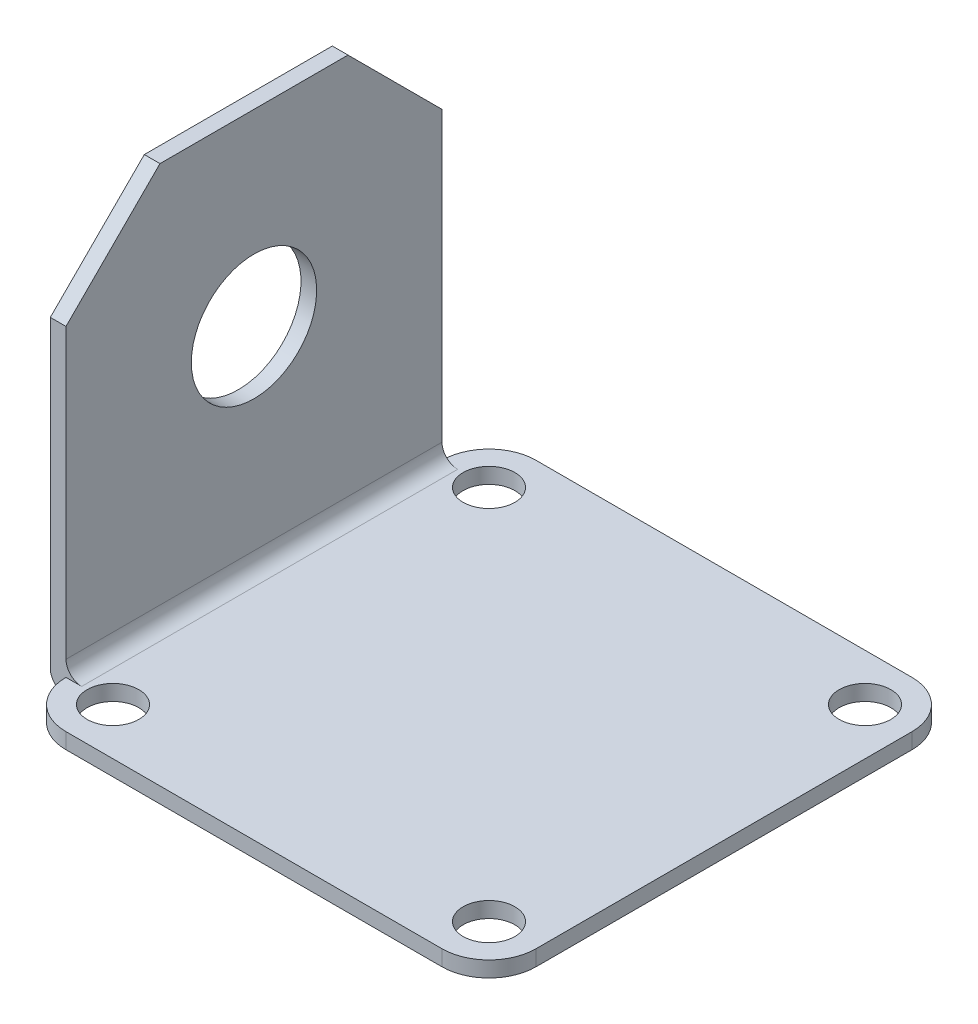
ISO-10303-21;
HEADER;
FILE_DESCRIPTION(('STEP AP214'),'2;1');
FILE_NAME('part.step','',(''),(''),'','','');
FILE_SCHEMA(('AUTOMOTIVE_DESIGN { 1 0 10303 214 1 1 1 1 }'));
ENDSEC;
DATA;
#1=APPLICATION_CONTEXT('core data for automotive mechanical design processes');
#2=APPLICATION_PROTOCOL_DEFINITION('international standard','automotive_design',2000,#1);
#3=PRODUCT_CONTEXT('',#1,'mechanical');
#4=PRODUCT('Part','Part','',(#3));
#5=PRODUCT_RELATED_PRODUCT_CATEGORY('part','',(#4));
#6=PRODUCT_DEFINITION_FORMATION('','',#4);
#7=PRODUCT_DEFINITION_CONTEXT('part definition',#1,'design');
#8=PRODUCT_DEFINITION('design','',#6,#7);
#9=PRODUCT_DEFINITION_SHAPE('','',#8);
#10=(LENGTH_UNIT() NAMED_UNIT(*) SI_UNIT(.MILLI.,.METRE.));
#11=(NAMED_UNIT(*) PLANE_ANGLE_UNIT() SI_UNIT($,.RADIAN.));
#12=(NAMED_UNIT(*) SI_UNIT($,.STERADIAN.) SOLID_ANGLE_UNIT());
#13=UNCERTAINTY_MEASURE_WITH_UNIT(LENGTH_MEASURE(1.E-05),#10,'distance_accuracy_value','');
#14=(GEOMETRIC_REPRESENTATION_CONTEXT(3) GLOBAL_UNCERTAINTY_ASSIGNED_CONTEXT((#13)) GLOBAL_UNIT_ASSIGNED_CONTEXT((#10,
#11,#12)) REPRESENTATION_CONTEXT('',''));
#15=CARTESIAN_POINT('',(0.,0.,0.));
#16=DIRECTION('',(0.,0.,1.));
#17=DIRECTION('',(1.,0.,0.));
#18=AXIS2_PLACEMENT_3D('',#15,#16,#17);
#19=CARTESIAN_POINT('',(3.,26.4,12.));
#20=DIRECTION('',(0.,-1.,0.));
#21=DIRECTION('',(0.,0.,-1.));
#22=AXIS2_PLACEMENT_3D('',#19,#20,#21);
#23=CYLINDRICAL_SURFACE('',#22,3.);
#24=CARTESIAN_POINT('',(3.,1.,12.));
#25=DIRECTION('',(0.,1.,0.));
#26=DIRECTION('',(0.,0.,1.));
#27=AXIS2_PLACEMENT_3D('',#24,#25,#26);
#28=CIRCLE('',#27,3.);
#29=CARTESIAN_POINT('',(0.,1.,12.));
#30=VERTEX_POINT('',#29);
#31=CARTESIAN_POINT('',(3.00000000000002,1.,15.));
#32=VERTEX_POINT('',#31);
#33=EDGE_CURVE('E283',#30,#32,#28,.T.);
#34=ORIENTED_EDGE('',*,*,#33,.F.);
#35=DIRECTION('',(0.,-1.,0.));
#36=VECTOR('',#35,1.);
#37=CARTESIAN_POINT('',(0.,26.4,12.));
#38=LINE('',#37,#36);
#39=CARTESIAN_POINT('',(0.,0.,12.));
#40=VERTEX_POINT('',#39);
#41=EDGE_CURVE('E189',#30,#40,#38,.T.);
#42=ORIENTED_EDGE('',*,*,#41,.T.);
#43=CARTESIAN_POINT('',(3.,0.,12.));
#44=DIRECTION('',(0.,1.,0.));
#45=DIRECTION('',(0.,0.,1.));
#46=AXIS2_PLACEMENT_3D('',#43,#44,#45);
#47=CIRCLE('',#46,3.);
#48=CARTESIAN_POINT('',(3.00000000000002,0.,15.));
#49=VERTEX_POINT('',#48);
#50=EDGE_CURVE('E297',#40,#49,#47,.T.);
#51=ORIENTED_EDGE('',*,*,#50,.T.);
#52=DIRECTION('',(0.,-1.,0.));
#53=VECTOR('',#52,1.);
#54=CARTESIAN_POINT('',(3.00000000000002,26.4,15.));
#55=LINE('',#54,#53);
#56=EDGE_CURVE('E187',#32,#49,#55,.T.);
#57=ORIENTED_EDGE('',*,*,#56,.F.);
#58=EDGE_LOOP('',(#34,#42,#51,#57));
#59=FACE_BOUND('',#58,.T.);
#60=ADVANCED_FACE('F33',(#59),#23,.T.);
#61=CARTESIAN_POINT('',(3.00000000000002,26.4,15.));
#62=DIRECTION('',(0.,0.,-1.));
#63=DIRECTION('',(-1.,0.,0.));
#64=AXIS2_PLACEMENT_3D('',#61,#62,#63);
#65=PLANE('',#64);
#66=DIRECTION('',(1.,0.,0.));
#67=VECTOR('',#66,1.);
#68=CARTESIAN_POINT('',(3.00000000000002,1.,15.));
#69=LINE('',#68,#67);
#70=CARTESIAN_POINT('',(27.,1.,15.));
#71=VERTEX_POINT('',#70);
#72=EDGE_CURVE('E281',#32,#71,#69,.T.);
#73=ORIENTED_EDGE('',*,*,#72,.F.);
#74=ORIENTED_EDGE('',*,*,#56,.T.);
#75=DIRECTION('',(1.,0.,0.));
#76=VECTOR('',#75,1.);
#77=CARTESIAN_POINT('',(3.00000000000002,0.,15.));
#78=LINE('',#77,#76);
#79=CARTESIAN_POINT('',(27.,0.,15.));
#80=VERTEX_POINT('',#79);
#81=EDGE_CURVE('E300',#49,#80,#78,.T.);
#82=ORIENTED_EDGE('',*,*,#81,.T.);
#83=DIRECTION('',(0.,-1.,0.));
#84=VECTOR('',#83,1.);
#85=CARTESIAN_POINT('',(27.,26.4,15.));
#86=LINE('',#85,#84);
#87=EDGE_CURVE('E185',#71,#80,#86,.T.);
#88=ORIENTED_EDGE('',*,*,#87,.F.);
#89=EDGE_LOOP('',(#73,#74,#82,#88));
#90=FACE_BOUND('',#89,.T.);
#91=ADVANCED_FACE('F335',(#90),#65,.F.);
#92=CARTESIAN_POINT('',(27.,26.4,12.));
#93=DIRECTION('',(0.,-1.,0.));
#94=DIRECTION('',(0.,0.,-1.));
#95=AXIS2_PLACEMENT_3D('',#92,#93,#94);
#96=CYLINDRICAL_SURFACE('',#95,3.);
#97=CARTESIAN_POINT('',(27.,1.,12.));
#98=DIRECTION('',(0.,1.,0.));
#99=DIRECTION('',(0.,0.,1.));
#100=AXIS2_PLACEMENT_3D('',#97,#98,#99);
#101=CIRCLE('',#100,3.);
#102=CARTESIAN_POINT('',(30.,1.,12.));
#103=VERTEX_POINT('',#102);
#104=EDGE_CURVE('E279',#71,#103,#101,.T.);
#105=ORIENTED_EDGE('',*,*,#104,.F.);
#106=ORIENTED_EDGE('',*,*,#87,.T.);
#107=CARTESIAN_POINT('',(27.,0.,12.));
#108=DIRECTION('',(0.,1.,0.));
#109=DIRECTION('',(0.,0.,1.));
#110=AXIS2_PLACEMENT_3D('',#107,#108,#109);
#111=CIRCLE('',#110,3.);
#112=CARTESIAN_POINT('',(30.,0.,12.));
#113=VERTEX_POINT('',#112);
#114=EDGE_CURVE('E303',#80,#113,#111,.T.);
#115=ORIENTED_EDGE('',*,*,#114,.T.);
#116=DIRECTION('',(0.,-1.,0.));
#117=VECTOR('',#116,1.);
#118=CARTESIAN_POINT('',(30.,26.4,12.));
#119=LINE('',#118,#117);
#120=EDGE_CURVE('E183',#103,#113,#119,.T.);
#121=ORIENTED_EDGE('',*,*,#120,.F.);
#122=EDGE_LOOP('',(#105,#106,#115,#121));
#123=FACE_BOUND('',#122,.T.);
#124=ADVANCED_FACE('F330',(#123),#96,.T.);
#125=CARTESIAN_POINT('',(30.,26.4,12.));
#126=DIRECTION('',(-1.,0.,0.));
#127=DIRECTION('',(0.,0.,1.));
#128=AXIS2_PLACEMENT_3D('',#125,#126,#127);
#129=PLANE('',#128);
#130=DIRECTION('',(0.,0.,-1.));
#131=VECTOR('',#130,1.);
#132=CARTESIAN_POINT('',(30.,1.,12.));
#133=LINE('',#132,#131);
#134=CARTESIAN_POINT('',(30.,1.,-12.));
#135=VERTEX_POINT('',#134);
#136=EDGE_CURVE('E277',#103,#135,#133,.T.);
#137=ORIENTED_EDGE('',*,*,#136,.F.);
#138=ORIENTED_EDGE('',*,*,#120,.T.);
#139=DIRECTION('',(0.,0.,-1.));
#140=VECTOR('',#139,1.);
#141=CARTESIAN_POINT('',(30.,0.,12.));
#142=LINE('',#141,#140);
#143=CARTESIAN_POINT('',(30.,0.,-12.));
#144=VERTEX_POINT('',#143);
#145=EDGE_CURVE('E306',#113,#144,#142,.T.);
#146=ORIENTED_EDGE('',*,*,#145,.T.);
#147=DIRECTION('',(0.,-1.,0.));
#148=VECTOR('',#147,1.);
#149=CARTESIAN_POINT('',(30.,26.4,-12.));
#150=LINE('',#149,#148);
#151=EDGE_CURVE('E181',#135,#144,#150,.T.);
#152=ORIENTED_EDGE('',*,*,#151,.F.);
#153=EDGE_LOOP('',(#137,#138,#146,#152));
#154=FACE_BOUND('',#153,.T.);
#155=ADVANCED_FACE('F326',(#154),#129,.F.);
#156=CARTESIAN_POINT('',(27.,26.4,-12.));
#157=DIRECTION('',(0.,-1.,0.));
#158=DIRECTION('',(0.,0.,-1.));
#159=AXIS2_PLACEMENT_3D('',#156,#157,#158);
#160=CYLINDRICAL_SURFACE('',#159,3.);
#161=CARTESIAN_POINT('',(27.,1.,-12.));
#162=DIRECTION('',(0.,1.,0.));
#163=DIRECTION('',(0.,0.,1.));
#164=AXIS2_PLACEMENT_3D('',#161,#162,#163);
#165=CIRCLE('',#164,3.);
#166=CARTESIAN_POINT('',(27.,1.,-15.));
#167=VERTEX_POINT('',#166);
#168=EDGE_CURVE('E275',#135,#167,#165,.T.);
#169=ORIENTED_EDGE('',*,*,#168,.F.);
#170=ORIENTED_EDGE('',*,*,#151,.T.);
#171=CARTESIAN_POINT('',(27.,0.,-12.));
#172=DIRECTION('',(0.,1.,0.));
#173=DIRECTION('',(0.,0.,1.));
#174=AXIS2_PLACEMENT_3D('',#171,#172,#173);
#175=CIRCLE('',#174,3.);
#176=CARTESIAN_POINT('',(27.,0.,-15.));
#177=VERTEX_POINT('',#176);
#178=EDGE_CURVE('E309',#144,#177,#175,.T.);
#179=ORIENTED_EDGE('',*,*,#178,.T.);
#180=DIRECTION('',(0.,-1.,0.));
#181=VECTOR('',#180,1.);
#182=CARTESIAN_POINT('',(27.,26.4,-15.));
#183=LINE('',#182,#181);
#184=EDGE_CURVE('E179',#167,#177,#183,.T.);
#185=ORIENTED_EDGE('',*,*,#184,.F.);
#186=EDGE_LOOP('',(#169,#170,#179,#185));
#187=FACE_BOUND('',#186,.T.);
#188=ADVANCED_FACE('F322',(#187),#160,.T.);
#189=CARTESIAN_POINT('',(27.,26.4,-15.));
#190=DIRECTION('',(0.,0.,1.));
#191=DIRECTION('',(1.,0.,0.));
#192=AXIS2_PLACEMENT_3D('',#189,#190,#191);
#193=PLANE('',#192);
#194=DIRECTION('',(-1.,0.,0.));
#195=VECTOR('',#194,1.);
#196=CARTESIAN_POINT('',(27.,1.,-15.));
#197=LINE('',#196,#195);
#198=CARTESIAN_POINT('',(3.00000000000002,1.,-15.));
#199=VERTEX_POINT('',#198);
#200=EDGE_CURVE('E242',#167,#199,#197,.T.);
#201=ORIENTED_EDGE('',*,*,#200,.F.);
#202=ORIENTED_EDGE('',*,*,#184,.T.);
#203=DIRECTION('',(-1.,0.,0.));
#204=VECTOR('',#203,1.);
#205=CARTESIAN_POINT('',(27.,0.,-15.));
#206=LINE('',#205,#204);
#207=CARTESIAN_POINT('',(3.00000000000002,0.,-15.));
#208=VERTEX_POINT('',#207);
#209=EDGE_CURVE('E170',#177,#208,#206,.T.);
#210=ORIENTED_EDGE('',*,*,#209,.T.);
#211=DIRECTION('',(0.,-1.,0.));
#212=VECTOR('',#211,1.);
#213=CARTESIAN_POINT('',(3.00000000000002,26.4,-15.));
#214=LINE('',#213,#212);
#215=EDGE_CURVE('E177',#199,#208,#214,.T.);
#216=ORIENTED_EDGE('',*,*,#215,.F.);
#217=EDGE_LOOP('',(#201,#202,#210,#216));
#218=FACE_BOUND('',#217,.T.);
#219=ADVANCED_FACE('F312',(#218),#193,.F.);
#220=CARTESIAN_POINT('',(3.,26.4,-12.));
#221=DIRECTION('',(0.,-1.,0.));
#222=DIRECTION('',(0.,0.,-1.));
#223=AXIS2_PLACEMENT_3D('',#220,#221,#222);
#224=CYLINDRICAL_SURFACE('',#223,3.);
#225=CARTESIAN_POINT('',(3.,1.,-12.));
#226=DIRECTION('',(0.,1.,0.));
#227=DIRECTION('',(0.,0.,1.));
#228=AXIS2_PLACEMENT_3D('',#225,#226,#227);
#229=CIRCLE('',#228,3.);
#230=CARTESIAN_POINT('',(0.,1.,-12.));
#231=VERTEX_POINT('',#230);
#232=EDGE_CURVE('E239',#199,#231,#229,.T.);
#233=ORIENTED_EDGE('',*,*,#232,.F.);
#234=ORIENTED_EDGE('',*,*,#215,.T.);
#235=CARTESIAN_POINT('',(3.,0.,-12.));
#236=DIRECTION('',(0.,1.,0.));
#237=DIRECTION('',(0.,0.,1.));
#238=AXIS2_PLACEMENT_3D('',#235,#236,#237);
#239=CIRCLE('',#238,3.);
#240=CARTESIAN_POINT('',(0.,0.,-12.));
#241=VERTEX_POINT('',#240);
#242=EDGE_CURVE('E165',#208,#241,#239,.T.);
#243=ORIENTED_EDGE('',*,*,#242,.T.);
#244=DIRECTION('',(0.,-1.,0.));
#245=VECTOR('',#244,1.);
#246=CARTESIAN_POINT('',(0.,26.4,-12.));
#247=LINE('',#246,#245);
#248=EDGE_CURVE('E167',#231,#241,#247,.T.);
#249=ORIENTED_EDGE('',*,*,#248,.F.);
#250=EDGE_LOOP('',(#233,#234,#243,#249));
#251=FACE_BOUND('',#250,.T.);
#252=ADVANCED_FACE('F247',(#251),#224,.T.);
#253=CARTESIAN_POINT('',(27.,26.4,12.));
#254=DIRECTION('',(0.,-1.,0.));
#255=DIRECTION('',(0.,0.,-1.));
#256=AXIS2_PLACEMENT_3D('',#253,#254,#255);
#257=CYLINDRICAL_SURFACE('',#256,1.65);
#258=CARTESIAN_POINT('',(27.,0.,12.));
#259=DIRECTION('',(0.,1.,0.));
#260=DIRECTION('',(0.,0.,1.));
#261=AXIS2_PLACEMENT_3D('',#258,#259,#260);
#262=CIRCLE('',#261,1.65);
#263=CARTESIAN_POINT('',(27.,0.,13.65));
#264=VERTEX_POINT('',#263);
#265=EDGE_CURVE('E294',#264,#264,#262,.T.);
#266=ORIENTED_EDGE('',*,*,#265,.F.);
#267=EDGE_LOOP('',(#266));
#268=FACE_BOUND('',#267,.T.);
#269=CARTESIAN_POINT('',(27.,1.,12.));
#270=DIRECTION('',(0.,1.,0.));
#271=DIRECTION('',(0.,0.,1.));
#272=AXIS2_PLACEMENT_3D('',#269,#270,#271);
#273=CIRCLE('',#272,1.65);
#274=CARTESIAN_POINT('',(27.,1.,13.65));
#275=VERTEX_POINT('',#274);
#276=EDGE_CURVE('E245',#275,#275,#273,.T.);
#277=ORIENTED_EDGE('',*,*,#276,.T.);
#278=EDGE_LOOP('',(#277));
#279=FACE_BOUND('',#278,.T.);
#280=ADVANCED_FACE('F386',(#268,#279),#257,.F.);
#281=CARTESIAN_POINT('',(3.00000000000001,26.4,12.));
#282=DIRECTION('',(0.,-1.,0.));
#283=DIRECTION('',(0.,0.,-1.));
#284=AXIS2_PLACEMENT_3D('',#281,#282,#283);
#285=CYLINDRICAL_SURFACE('',#284,1.65);
#286=CARTESIAN_POINT('',(3.00000000000001,0.,12.));
#287=DIRECTION('',(0.,1.,0.));
#288=DIRECTION('',(0.,0.,-1.));
#289=AXIS2_PLACEMENT_3D('',#286,#287,#288);
#290=CIRCLE('',#289,1.65);
#291=CARTESIAN_POINT('',(3.00000000000001,0.,10.35));
#292=VERTEX_POINT('',#291);
#293=EDGE_CURVE('E291',#292,#292,#290,.T.);
#294=ORIENTED_EDGE('',*,*,#293,.F.);
#295=EDGE_LOOP('',(#294));
#296=FACE_BOUND('',#295,.T.);
#297=CARTESIAN_POINT('',(3.00000000000001,1.,12.));
#298=DIRECTION('',(0.,1.,0.));
#299=DIRECTION('',(0.,0.,1.));
#300=AXIS2_PLACEMENT_3D('',#297,#298,#299);
#301=CIRCLE('',#300,1.65);
#302=CARTESIAN_POINT('',(3.00000000000001,1.,13.65));
#303=VERTEX_POINT('',#302);
#304=EDGE_CURVE('E269',#303,#303,#301,.T.);
#305=ORIENTED_EDGE('',*,*,#304,.T.);
#306=EDGE_LOOP('',(#305));
#307=FACE_BOUND('',#306,.T.);
#308=ADVANCED_FACE('F382',(#296,#307),#285,.F.);
#309=CARTESIAN_POINT('',(3.00000000000001,26.4,-12.));
#310=DIRECTION('',(0.,-1.,0.));
#311=DIRECTION('',(0.,0.,-1.));
#312=AXIS2_PLACEMENT_3D('',#309,#310,#311);
#313=CYLINDRICAL_SURFACE('',#312,1.65);
#314=CARTESIAN_POINT('',(3.00000000000001,0.,-12.));
#315=DIRECTION('',(0.,1.,0.));
#316=DIRECTION('',(0.,0.,1.));
#317=AXIS2_PLACEMENT_3D('',#314,#315,#316);
#318=CIRCLE('',#317,1.65);
#319=CARTESIAN_POINT('',(3.00000000000001,0.,-10.35));
#320=VERTEX_POINT('',#319);
#321=EDGE_CURVE('E288',#320,#320,#318,.T.);
#322=ORIENTED_EDGE('',*,*,#321,.F.);
#323=EDGE_LOOP('',(#322));
#324=FACE_BOUND('',#323,.T.);
#325=CARTESIAN_POINT('',(3.00000000000001,1.,-12.));
#326=DIRECTION('',(0.,1.,0.));
#327=DIRECTION('',(0.,0.,1.));
#328=AXIS2_PLACEMENT_3D('',#325,#326,#327);
#329=CIRCLE('',#328,1.65);
#330=CARTESIAN_POINT('',(3.00000000000001,1.,-10.35));
#331=VERTEX_POINT('',#330);
#332=EDGE_CURVE('E198',#331,#331,#329,.T.);
#333=ORIENTED_EDGE('',*,*,#332,.T.);
#334=EDGE_LOOP('',(#333));
#335=FACE_BOUND('',#334,.T.);
#336=ADVANCED_FACE('F378',(#324,#335),#313,.F.);
#337=CARTESIAN_POINT('',(27.,26.4,-12.));
#338=DIRECTION('',(0.,-1.,0.));
#339=DIRECTION('',(0.,0.,-1.));
#340=AXIS2_PLACEMENT_3D('',#337,#338,#339);
#341=CYLINDRICAL_SURFACE('',#340,1.65);
#342=CARTESIAN_POINT('',(27.,0.,-12.));
#343=DIRECTION('',(0.,1.,0.));
#344=DIRECTION('',(0.,0.,-1.));
#345=AXIS2_PLACEMENT_3D('',#342,#343,#344);
#346=CIRCLE('',#345,1.65);
#347=CARTESIAN_POINT('',(27.,0.,-13.65));
#348=VERTEX_POINT('',#347);
#349=EDGE_CURVE('E285',#348,#348,#346,.T.);
#350=ORIENTED_EDGE('',*,*,#349,.F.);
#351=EDGE_LOOP('',(#350));
#352=FACE_BOUND('',#351,.T.);
#353=CARTESIAN_POINT('',(27.,1.,-12.));
#354=DIRECTION('',(0.,1.,0.));
#355=DIRECTION('',(0.,0.,1.));
#356=AXIS2_PLACEMENT_3D('',#353,#354,#355);
#357=CIRCLE('',#356,1.65);
#358=CARTESIAN_POINT('',(27.,1.,-10.35));
#359=VERTEX_POINT('',#358);
#360=EDGE_CURVE('E195',#359,#359,#357,.T.);
#361=ORIENTED_EDGE('',*,*,#360,.T.);
#362=EDGE_LOOP('',(#361));
#363=FACE_BOUND('',#362,.T.);
#364=ADVANCED_FACE('F375',(#352,#363),#341,.F.);
#365=CARTESIAN_POINT('',(3.,26.4,12.));
#366=DIRECTION('',(0.,1.,0.));
#367=DIRECTION('',(0.,0.,1.));
#368=AXIS2_PLACEMENT_3D('',#365,#366,#367);
#369=PLANE('',#368);
#370=DIRECTION('',(-1.,0.,0.));
#371=VECTOR('',#370,1.);
#372=CARTESIAN_POINT('',(1.00000000000001,26.4,6.));
#373=LINE('',#372,#371);
#374=CARTESIAN_POINT('',(0.,26.4,6.));
#375=VERTEX_POINT('',#374);
#376=CARTESIAN_POINT('',(-0.999999999999994,26.4,6.));
#377=VERTEX_POINT('',#376);
#378=EDGE_CURVE('E139',#375,#377,#373,.T.);
#379=ORIENTED_EDGE('',*,*,#378,.F.);
#380=DIRECTION('',(0.,0.,1.));
#381=VECTOR('',#380,1.);
#382=CARTESIAN_POINT('',(0.,26.4,-16.5358170068647));
#383=LINE('',#382,#381);
#384=CARTESIAN_POINT('',(0.,26.4,-6.));
#385=VERTEX_POINT('',#384);
#386=EDGE_CURVE('E199',#385,#375,#383,.T.);
#387=ORIENTED_EDGE('',*,*,#386,.F.);
#388=DIRECTION('',(-1.,0.,0.));
#389=VECTOR('',#388,1.);
#390=CARTESIAN_POINT('',(1.00000000000001,26.4,-6.));
#391=LINE('',#390,#389);
#392=CARTESIAN_POINT('',(-0.999999999999994,26.4,-6.));
#393=VERTEX_POINT('',#392);
#394=EDGE_CURVE('E163',#385,#393,#391,.T.);
#395=ORIENTED_EDGE('',*,*,#394,.T.);
#396=DIRECTION('',(0.,0.,1.));
#397=VECTOR('',#396,1.);
#398=CARTESIAN_POINT('',(-0.999999999999995,26.4,-12.));
#399=LINE('',#398,#397);
#400=EDGE_CURVE('E156',#393,#377,#399,.T.);
#401=ORIENTED_EDGE('',*,*,#400,.T.);
#402=EDGE_LOOP('',(#379,#387,#395,#401));
#403=FACE_BOUND('',#402,.T.);
#404=ADVANCED_FACE('F162',(#403),#369,.T.);
#405=CARTESIAN_POINT('',(3.,0.,12.));
#406=DIRECTION('',(0.,1.,0.));
#407=DIRECTION('',(0.,0.,1.));
#408=AXIS2_PLACEMENT_3D('',#405,#406,#407);
#409=PLANE('',#408);
#410=ORIENTED_EDGE('',*,*,#321,.T.);
#411=EDGE_LOOP('',(#410));
#412=FACE_BOUND('',#411,.T.);
#413=ORIENTED_EDGE('',*,*,#265,.T.);
#414=EDGE_LOOP('',(#413));
#415=FACE_BOUND('',#414,.T.);
#416=ORIENTED_EDGE('',*,*,#50,.F.);
#417=DIRECTION('',(0.,0.,1.));
#418=VECTOR('',#417,1.);
#419=CARTESIAN_POINT('',(0.,0.,12.));
#420=LINE('',#419,#418);
#421=EDGE_CURVE('E219',#40,#241,#420,.F.);
#422=ORIENTED_EDGE('',*,*,#421,.T.);
#423=ORIENTED_EDGE('',*,*,#242,.F.);
#424=ORIENTED_EDGE('',*,*,#209,.F.);
#425=ORIENTED_EDGE('',*,*,#178,.F.);
#426=ORIENTED_EDGE('',*,*,#145,.F.);
#427=ORIENTED_EDGE('',*,*,#114,.F.);
#428=ORIENTED_EDGE('',*,*,#81,.F.);
#429=EDGE_LOOP('',(#416,#422,#423,#424,#425,#426,#427,#428));
#430=FACE_BOUND('',#429,.T.);
#431=ORIENTED_EDGE('',*,*,#293,.T.);
#432=EDGE_LOOP('',(#431));
#433=FACE_BOUND('',#432,.T.);
#434=ORIENTED_EDGE('',*,*,#349,.T.);
#435=EDGE_LOOP('',(#434));
#436=FACE_BOUND('',#435,.T.);
#437=ADVANCED_FACE('F316',(#412,#415,#430,#433,#436),#409,.F.);
#438=CARTESIAN_POINT('',(-0.999999999999995,26.4,-12.));
#439=DIRECTION('',(1.,0.,0.));
#440=DIRECTION('',(0.,0.,-1.));
#441=AXIS2_PLACEMENT_3D('',#438,#439,#440);
#442=PLANE('',#441);
#443=CARTESIAN_POINT('',(-0.999999999999994,14.4,0.));
#444=DIRECTION('',(-1.,0.,0.));
#445=DIRECTION('',(0.,0.,1.));
#446=AXIS2_PLACEMENT_3D('',#443,#444,#445);
#447=CIRCLE('',#446,4.);
#448=CARTESIAN_POINT('',(-0.999999999999994,14.4,4.));
#449=VERTEX_POINT('',#448);
#450=EDGE_CURVE('E203',#449,#449,#447,.T.);
#451=ORIENTED_EDGE('',*,*,#450,.F.);
#452=EDGE_LOOP('',(#451));
#453=FACE_BOUND('',#452,.T.);
#454=DIRECTION('',(0.,-1.,0.));
#455=VECTOR('',#454,1.);
#456=CARTESIAN_POINT('',(-0.999999999999995,26.4,-12.));
#457=LINE('',#456,#455);
#458=CARTESIAN_POINT('',(-0.999999999999995,20.4,-12.));
#459=VERTEX_POINT('',#458);
#460=CARTESIAN_POINT('',(-0.999999999999995,1.,-12.));
#461=VERTEX_POINT('',#460);
#462=EDGE_CURVE('E164',#459,#461,#457,.T.);
#463=ORIENTED_EDGE('',*,*,#462,.T.);
#464=DIRECTION('',(0.,0.,1.));
#465=VECTOR('',#464,1.);
#466=CARTESIAN_POINT('',(-0.999999999999995,1.,-12.));
#467=LINE('',#466,#465);
#468=CARTESIAN_POINT('',(-0.999999999999993,1.,12.));
#469=VERTEX_POINT('',#468);
#470=EDGE_CURVE('E215',#461,#469,#467,.T.);
#471=ORIENTED_EDGE('',*,*,#470,.T.);
#472=DIRECTION('',(0.,-1.,0.));
#473=VECTOR('',#472,1.);
#474=CARTESIAN_POINT('',(-0.999999999999993,26.4,12.));
#475=LINE('',#474,#473);
#476=CARTESIAN_POINT('',(-0.999999999999993,20.4,12.));
#477=VERTEX_POINT('',#476);
#478=EDGE_CURVE('E159',#477,#469,#475,.T.);
#479=ORIENTED_EDGE('',*,*,#478,.F.);
#480=DIRECTION('',(0.,-0.707106781186547,0.707106781186548));
#481=VECTOR('',#480,1.);
#482=CARTESIAN_POINT('',(-0.999999999999993,20.4,12.));
#483=LINE('',#482,#481);
#484=EDGE_CURVE('E142',#377,#477,#483,.T.);
#485=ORIENTED_EDGE('',*,*,#484,.F.);
#486=ORIENTED_EDGE('',*,*,#400,.F.);
#487=DIRECTION('',(0.,0.707106781186547,0.707106781186548));
#488=VECTOR('',#487,1.);
#489=CARTESIAN_POINT('',(-0.999999999999995,20.4,-12.));
#490=LINE('',#489,#488);
#491=EDGE_CURVE('E257',#459,#393,#490,.T.);
#492=ORIENTED_EDGE('',*,*,#491,.F.);
#493=EDGE_LOOP('',(#463,#471,#479,#485,#486,#492));
#494=FACE_BOUND('',#493,.T.);
#495=ADVANCED_FACE('F35',(#453,#494),#442,.F.);
#496=CARTESIAN_POINT('',(-0.999999999999993,26.4,12.));
#497=DIRECTION('',(0.,0.,-1.));
#498=DIRECTION('',(-1.,0.,0.));
#499=AXIS2_PLACEMENT_3D('',#496,#497,#498);
#500=PLANE('',#499);
#501=ORIENTED_EDGE('',*,*,#478,.T.);
#502=CARTESIAN_POINT('',(0.,1.,12.));
#503=DIRECTION('',(0.,0.,-1.));
#504=DIRECTION('',(-1.,0.,0.));
#505=AXIS2_PLACEMENT_3D('',#502,#503,#504);
#506=CIRCLE('',#505,1.);
#507=EDGE_CURVE('E217',#469,#40,#506,.F.);
#508=ORIENTED_EDGE('',*,*,#507,.T.);
#509=ORIENTED_EDGE('',*,*,#41,.F.);
#510=DIRECTION('',(-1.,0.,0.));
#511=VECTOR('',#510,1.);
#512=CARTESIAN_POINT('',(0.,1.,12.));
#513=LINE('',#512,#511);
#514=CARTESIAN_POINT('',(1.,1.,12.));
#515=VERTEX_POINT('',#514);
#516=EDGE_CURVE('E211',#515,#30,#513,.T.);
#517=ORIENTED_EDGE('',*,*,#516,.F.);
#518=CARTESIAN_POINT('',(1.,2.,12.));
#519=DIRECTION('',(0.,0.,-1.));
#520=DIRECTION('',(-1.,0.,0.));
#521=AXIS2_PLACEMENT_3D('',#518,#519,#520);
#522=CIRCLE('',#521,1.);
#523=CARTESIAN_POINT('',(0.,2.,12.));
#524=VERTEX_POINT('',#523);
#525=EDGE_CURVE('E41',#515,#524,#522,.T.);
#526=ORIENTED_EDGE('',*,*,#525,.T.);
#527=CARTESIAN_POINT('',(0.,20.4,12.));
#528=VERTEX_POINT('',#527);
#529=EDGE_CURVE('E190',#528,#524,#38,.T.);
#530=ORIENTED_EDGE('',*,*,#529,.F.);
#531=DIRECTION('',(-1.,0.,0.));
#532=VECTOR('',#531,1.);
#533=CARTESIAN_POINT('',(1.00000000000001,20.4,12.));
#534=LINE('',#533,#532);
#535=EDGE_CURVE('E150',#528,#477,#534,.T.);
#536=ORIENTED_EDGE('',*,*,#535,.T.);
#537=EDGE_LOOP('',(#501,#508,#509,#517,#526,#530,#536));
#538=FACE_BOUND('',#537,.T.);
#539=ADVANCED_FACE('F224',(#538),#500,.F.);
#540=CARTESIAN_POINT('',(0.,26.4,-12.));
#541=DIRECTION('',(0.,0.,1.));
#542=DIRECTION('',(1.,0.,0.));
#543=AXIS2_PLACEMENT_3D('',#540,#541,#542);
#544=PLANE('',#543);
#545=ORIENTED_EDGE('',*,*,#248,.T.);
#546=CARTESIAN_POINT('',(0.,1.,-12.));
#547=DIRECTION('',(0.,0.,1.));
#548=DIRECTION('',(1.,0.,0.));
#549=AXIS2_PLACEMENT_3D('',#546,#547,#548);
#550=CIRCLE('',#549,1.);
#551=EDGE_CURVE('E53',#241,#461,#550,.F.);
#552=ORIENTED_EDGE('',*,*,#551,.T.);
#553=ORIENTED_EDGE('',*,*,#462,.F.);
#554=DIRECTION('',(-1.,0.,0.));
#555=VECTOR('',#554,1.);
#556=CARTESIAN_POINT('',(1.00000000000001,20.4,-12.));
#557=LINE('',#556,#555);
#558=CARTESIAN_POINT('',(0.,20.4,-12.));
#559=VERTEX_POINT('',#558);
#560=EDGE_CURVE('E259',#559,#459,#557,.T.);
#561=ORIENTED_EDGE('',*,*,#560,.F.);
#562=CARTESIAN_POINT('',(0.,2.,-12.));
#563=VERTEX_POINT('',#562);
#564=EDGE_CURVE('E174',#559,#563,#247,.T.);
#565=ORIENTED_EDGE('',*,*,#564,.T.);
#566=CARTESIAN_POINT('',(1.,2.,-11.9999999999999));
#567=DIRECTION('',(0.,0.,1.));
#568=DIRECTION('',(1.,0.,0.));
#569=AXIS2_PLACEMENT_3D('',#566,#567,#568);
#570=CIRCLE('',#569,1.);
#571=CARTESIAN_POINT('',(1.,1.,-11.9999999999999));
#572=VERTEX_POINT('',#571);
#573=EDGE_CURVE('E11',#563,#572,#570,.T.);
#574=ORIENTED_EDGE('',*,*,#573,.T.);
#575=DIRECTION('',(1.,0.,0.));
#576=VECTOR('',#575,1.);
#577=CARTESIAN_POINT('',(8.81550807393855E-13,1.,-12.));
#578=LINE('',#577,#576);
#579=EDGE_CURVE('E47',#231,#572,#578,.T.);
#580=ORIENTED_EDGE('',*,*,#579,.F.);
#581=EDGE_LOOP('',(#545,#552,#553,#561,#565,#574,#580));
#582=FACE_BOUND('',#581,.T.);
#583=ADVANCED_FACE('F234',(#582),#544,.F.);
#584=CARTESIAN_POINT('',(0.,1.,-16.5358170068647));
#585=DIRECTION('',(-1.,0.,0.));
#586=DIRECTION('',(0.,0.,1.));
#587=AXIS2_PLACEMENT_3D('',#584,#585,#586);
#588=PLANE('',#587);
#589=CARTESIAN_POINT('',(0.,14.4,0.));
#590=DIRECTION('',(-1.,0.,0.));
#591=DIRECTION('',(0.,0.,1.));
#592=AXIS2_PLACEMENT_3D('',#589,#590,#591);
#593=CIRCLE('',#592,4.);
#594=CARTESIAN_POINT('',(0.,14.4,4.));
#595=VERTEX_POINT('',#594);
#596=EDGE_CURVE('E200',#595,#595,#593,.T.);
#597=ORIENTED_EDGE('',*,*,#596,.T.);
#598=EDGE_LOOP('',(#597));
#599=FACE_BOUND('',#598,.T.);
#600=ORIENTED_EDGE('',*,*,#529,.T.);
#601=DIRECTION('',(0.,0.,1.));
#602=VECTOR('',#601,1.);
#603=CARTESIAN_POINT('',(0.,2.,-16.5358170068647));
#604=LINE('',#603,#602);
#605=EDGE_CURVE('E213',#524,#563,#604,.F.);
#606=ORIENTED_EDGE('',*,*,#605,.T.);
#607=ORIENTED_EDGE('',*,*,#564,.F.);
#608=DIRECTION('',(0.,0.707106781186547,0.707106781186548));
#609=VECTOR('',#608,1.);
#610=CARTESIAN_POINT('',(0.,8.43209149656765,-23.9679085034324));
#611=LINE('',#610,#609);
#612=EDGE_CURVE('E194',#559,#385,#611,.T.);
#613=ORIENTED_EDGE('',*,*,#612,.T.);
#614=ORIENTED_EDGE('',*,*,#386,.T.);
#615=DIRECTION('',(0.,-0.707106781186547,0.707106781186548));
#616=VECTOR('',#615,1.);
#617=CARTESIAN_POINT('',(0.,24.9679085034324,7.43209149656764));
#618=LINE('',#617,#616);
#619=EDGE_CURVE('E145',#375,#528,#618,.T.);
#620=ORIENTED_EDGE('',*,*,#619,.T.);
#621=EDGE_LOOP('',(#600,#606,#607,#613,#614,#620));
#622=FACE_BOUND('',#621,.T.);
#623=ADVANCED_FACE('F230',(#599,#622),#588,.F.);
#624=CARTESIAN_POINT('',(0.,1.,16.2321912013306));
#625=DIRECTION('',(0.,1.,0.));
#626=DIRECTION('',(0.,0.,1.));
#627=AXIS2_PLACEMENT_3D('',#624,#625,#626);
#628=PLANE('',#627);
#629=ORIENTED_EDGE('',*,*,#360,.F.);
#630=EDGE_LOOP('',(#629));
#631=FACE_BOUND('',#630,.T.);
#632=ORIENTED_EDGE('',*,*,#332,.F.);
#633=EDGE_LOOP('',(#632));
#634=FACE_BOUND('',#633,.T.);
#635=ORIENTED_EDGE('',*,*,#304,.F.);
#636=EDGE_LOOP('',(#635));
#637=FACE_BOUND('',#636,.T.);
#638=ORIENTED_EDGE('',*,*,#276,.F.);
#639=EDGE_LOOP('',(#638));
#640=FACE_BOUND('',#639,.T.);
#641=DIRECTION('',(0.,0.,1.));
#642=VECTOR('',#641,1.);
#643=CARTESIAN_POINT('',(1.,1.,16.2321912013306));
#644=LINE('',#643,#642);
#645=EDGE_CURVE('E208',#572,#515,#644,.T.);
#646=ORIENTED_EDGE('',*,*,#645,.T.);
#647=ORIENTED_EDGE('',*,*,#516,.T.);
#648=ORIENTED_EDGE('',*,*,#33,.T.);
#649=ORIENTED_EDGE('',*,*,#72,.T.);
#650=ORIENTED_EDGE('',*,*,#104,.T.);
#651=ORIENTED_EDGE('',*,*,#136,.T.);
#652=ORIENTED_EDGE('',*,*,#168,.T.);
#653=ORIENTED_EDGE('',*,*,#200,.T.);
#654=ORIENTED_EDGE('',*,*,#232,.T.);
#655=ORIENTED_EDGE('',*,*,#579,.T.);
#656=EDGE_LOOP('',(#646,#647,#648,#649,#650,#651,#652,#653,#654,#655));
#657=FACE_BOUND('',#656,.T.);
#658=ADVANCED_FACE('F237',(#631,#634,#637,#640,#657),#628,.T.);
#659=CARTESIAN_POINT('',(1.00000000000001,14.4,0.));
#660=DIRECTION('',(-1.,0.,0.));
#661=DIRECTION('',(0.,0.,1.));
#662=AXIS2_PLACEMENT_3D('',#659,#660,#661);
#663=CYLINDRICAL_SURFACE('',#662,4.);
#664=ORIENTED_EDGE('',*,*,#450,.T.);
#665=EDGE_LOOP('',(#664));
#666=FACE_BOUND('',#665,.T.);
#667=ORIENTED_EDGE('',*,*,#596,.F.);
#668=EDGE_LOOP('',(#667));
#669=FACE_BOUND('',#668,.T.);
#670=ADVANCED_FACE('F360',(#666,#669),#663,.F.);
#671=CARTESIAN_POINT('',(1.00000000000001,20.4,-12.));
#672=DIRECTION('',(0.,-0.707106781186548,0.707106781186547));
#673=DIRECTION('',(0.,-0.707106781186547,-0.707106781186548));
#674=AXIS2_PLACEMENT_3D('',#671,#672,#673);
#675=PLANE('',#674);
#676=ORIENTED_EDGE('',*,*,#560,.T.);
#677=ORIENTED_EDGE('',*,*,#491,.T.);
#678=ORIENTED_EDGE('',*,*,#394,.F.);
#679=ORIENTED_EDGE('',*,*,#612,.F.);
#680=EDGE_LOOP('',(#676,#677,#678,#679));
#681=FACE_BOUND('',#680,.T.);
#682=ADVANCED_FACE('F363',(#681),#675,.F.);
#683=CARTESIAN_POINT('',(1.00000000000001,20.4,12.));
#684=DIRECTION('',(0.,-0.707106781186548,-0.707106781186547));
#685=DIRECTION('',(0.,0.707106781186547,-0.707106781186548));
#686=AXIS2_PLACEMENT_3D('',#683,#684,#685);
#687=PLANE('',#686);
#688=ORIENTED_EDGE('',*,*,#378,.T.);
#689=ORIENTED_EDGE('',*,*,#484,.T.);
#690=ORIENTED_EDGE('',*,*,#535,.F.);
#691=ORIENTED_EDGE('',*,*,#619,.F.);
#692=EDGE_LOOP('',(#688,#689,#690,#691));
#693=FACE_BOUND('',#692,.T.);
#694=ADVANCED_FACE('F141',(#693),#687,.F.);
#695=CARTESIAN_POINT('',(1.,2.,16.2321912013306));
#696=DIRECTION('',(0.,0.,1.));
#697=DIRECTION('',(1.,0.,0.));
#698=AXIS2_PLACEMENT_3D('',#695,#696,#697);
#699=CYLINDRICAL_SURFACE('',#698,1.);
#700=ORIENTED_EDGE('',*,*,#573,.F.);
#701=ORIENTED_EDGE('',*,*,#605,.F.);
#702=ORIENTED_EDGE('',*,*,#525,.F.);
#703=ORIENTED_EDGE('',*,*,#645,.F.);
#704=EDGE_LOOP('',(#700,#701,#702,#703));
#705=FACE_BOUND('',#704,.T.);
#706=ADVANCED_FACE('F233',(#705),#699,.F.);
#707=CARTESIAN_POINT('',(0.,1.,-12.));
#708=DIRECTION('',(0.,0.,1.));
#709=DIRECTION('',(1.,0.,0.));
#710=AXIS2_PLACEMENT_3D('',#707,#708,#709);
#711=CYLINDRICAL_SURFACE('',#710,1.);
#712=ORIENTED_EDGE('',*,*,#551,.F.);
#713=ORIENTED_EDGE('',*,*,#421,.F.);
#714=ORIENTED_EDGE('',*,*,#507,.F.);
#715=ORIENTED_EDGE('',*,*,#470,.F.);
#716=EDGE_LOOP('',(#712,#713,#714,#715));
#717=FACE_BOUND('',#716,.T.);
#718=ADVANCED_FACE('F255',(#717),#711,.T.);
#719=CLOSED_SHELL('',(#60,#91,#124,#155,#188,#219,#252,#280,#308,#336,#364,#404,#437,#495,#539,
#583,#623,#658,#670,#682,#694,#706,#718));
#720=MANIFOLD_SOLID_BREP('B2',#719);
#721=ADVANCED_BREP_SHAPE_REPRESENTATION('',(#18,#720),#14);
#722=SHAPE_DEFINITION_REPRESENTATION(#9,#721);
ENDSEC;
END-ISO-10303-21;
